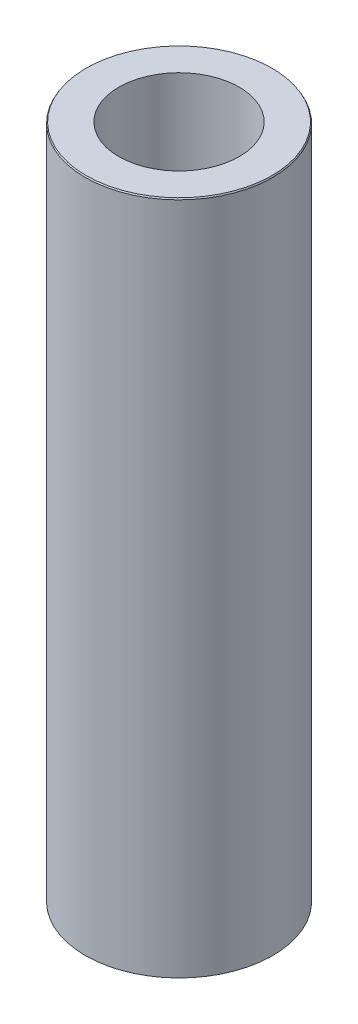
ISO-10303-21;
HEADER;
FILE_DESCRIPTION(('STEP AP214'),'2;1');
FILE_NAME('part.step','',(''),(''),'','','');
FILE_SCHEMA(('AUTOMOTIVE_DESIGN { 1 0 10303 214 1 1 1 1 }'));
ENDSEC;
DATA;
#1=APPLICATION_CONTEXT('core data for automotive mechanical design processes');
#2=APPLICATION_PROTOCOL_DEFINITION('international standard','automotive_design',2000,#1);
#3=PRODUCT_CONTEXT('',#1,'mechanical');
#4=PRODUCT('Part','Part','',(#3));
#5=PRODUCT_RELATED_PRODUCT_CATEGORY('part','',(#4));
#6=PRODUCT_DEFINITION_FORMATION('','',#4);
#7=PRODUCT_DEFINITION_CONTEXT('part definition',#1,'design');
#8=PRODUCT_DEFINITION('design','',#6,#7);
#9=PRODUCT_DEFINITION_SHAPE('','',#8);
#10=(LENGTH_UNIT() NAMED_UNIT(*) SI_UNIT(.MILLI.,.METRE.));
#11=(NAMED_UNIT(*) PLANE_ANGLE_UNIT() SI_UNIT($,.RADIAN.));
#12=(NAMED_UNIT(*) SI_UNIT($,.STERADIAN.) SOLID_ANGLE_UNIT());
#13=UNCERTAINTY_MEASURE_WITH_UNIT(LENGTH_MEASURE(1.E-05),#10,'distance_accuracy_value','');
#14=(GEOMETRIC_REPRESENTATION_CONTEXT(3) GLOBAL_UNCERTAINTY_ASSIGNED_CONTEXT((#13)) GLOBAL_UNIT_ASSIGNED_CONTEXT((#10,
#11,#12)) REPRESENTATION_CONTEXT('',''));
#15=CARTESIAN_POINT('',(0.,0.,0.));
#16=DIRECTION('',(0.,0.,1.));
#17=DIRECTION('',(1.,0.,0.));
#18=AXIS2_PLACEMENT_3D('',#15,#16,#17);
#19=CARTESIAN_POINT('',(0.,306.475914403811,0.));
#20=DIRECTION('',(0.,-1.,0.));
#21=DIRECTION('',(0.,0.,-1.));
#22=AXIS2_PLACEMENT_3D('',#19,#20,#21);
#23=CYLINDRICAL_SURFACE('',#22,42.5);
#24=CARTESIAN_POINT('',(0.,305.886490444852,0.));
#25=DIRECTION('',(0.,1.,0.));
#26=DIRECTION('',(0.,0.,1.));
#27=AXIS2_PLACEMENT_3D('',#24,#25,#26);
#28=CIRCLE('',#27,42.5);
#29=CARTESIAN_POINT('',(0.,305.886490444852,42.5));
#30=VERTEX_POINT('',#29);
#31=EDGE_CURVE('E50',#30,#30,#28,.F.);
#32=ORIENTED_EDGE('',*,*,#31,.T.);
#33=EDGE_LOOP('',(#32));
#34=FACE_BOUND('',#33,.T.);
#35=CARTESIAN_POINT('',(0.,0.340304081371645,0.));
#36=DIRECTION('',(0.,1.,0.));
#37=DIRECTION('',(0.,0.,1.));
#38=AXIS2_PLACEMENT_3D('',#35,#36,#37);
#39=CIRCLE('',#38,42.5);
#40=CARTESIAN_POINT('',(0.,0.340304081371645,42.5));
#41=VERTEX_POINT('',#40);
#42=EDGE_CURVE('E51',#41,#41,#39,.T.);
#43=ORIENTED_EDGE('',*,*,#42,.T.);
#44=EDGE_LOOP('',(#43));
#45=FACE_BOUND('',#44,.T.);
#46=ADVANCED_FACE('F39',(#34,#45),#23,.T.);
#47=CARTESIAN_POINT('',(0.,306.475914403811,0.));
#48=DIRECTION('',(0.,1.,0.));
#49=DIRECTION('',(0.,0.,1.));
#50=AXIS2_PLACEMENT_3D('',#47,#48,#49);
#51=PLANE('',#50);
#52=CARTESIAN_POINT('',(0.,306.475914403811,0.));
#53=DIRECTION('',(0.,1.,0.));
#54=DIRECTION('',(0.,0.,1.));
#55=AXIS2_PLACEMENT_3D('',#52,#53,#54);
#56=CIRCLE('',#55,42.1596959186283);
#57=CARTESIAN_POINT('',(0.,306.475914403811,42.1596959186283));
#58=VERTEX_POINT('',#57);
#59=EDGE_CURVE('E54',#58,#58,#56,.T.);
#60=ORIENTED_EDGE('',*,*,#59,.T.);
#61=EDGE_LOOP('',(#60));
#62=FACE_BOUND('',#61,.T.);
#63=CARTESIAN_POINT('',(0.,306.475914403811,0.));
#64=DIRECTION('',(0.,1.,0.));
#65=DIRECTION('',(0.,0.,1.));
#66=AXIS2_PLACEMENT_3D('',#63,#64,#65);
#67=CIRCLE('',#66,27.3050333120892);
#68=CARTESIAN_POINT('',(0.,306.475914403811,27.3050333120892));
#69=VERTEX_POINT('',#68);
#70=EDGE_CURVE('E58',#69,#69,#67,.T.);
#71=ORIENTED_EDGE('',*,*,#70,.F.);
#72=EDGE_LOOP('',(#71));
#73=FACE_BOUND('',#72,.T.);
#74=ADVANCED_FACE('F69',(#62,#73),#51,.T.);
#75=CARTESIAN_POINT('',(0.,0.,0.));
#76=DIRECTION('',(0.,1.,0.));
#77=DIRECTION('',(0.,0.,1.));
#78=AXIS2_PLACEMENT_3D('',#75,#76,#77);
#79=PLANE('',#78);
#80=CARTESIAN_POINT('',(0.,0.,0.));
#81=DIRECTION('',(0.,1.,0.));
#82=DIRECTION('',(0.,0.,1.));
#83=AXIS2_PLACEMENT_3D('',#80,#81,#82);
#84=CIRCLE('',#83,41.9105760410412);
#85=CARTESIAN_POINT('',(0.,0.,41.9105760410412));
#86=VERTEX_POINT('',#85);
#87=EDGE_CURVE('E10',#86,#86,#84,.F.);
#88=ORIENTED_EDGE('',*,*,#87,.T.);
#89=EDGE_LOOP('',(#88));
#90=FACE_BOUND('',#89,.T.);
#91=CARTESIAN_POINT('',(0.,0.,0.));
#92=DIRECTION('',(0.,1.,0.));
#93=DIRECTION('',(0.,0.,1.));
#94=AXIS2_PLACEMENT_3D('',#91,#92,#93);
#95=CIRCLE('',#94,27.3050333120892);
#96=CARTESIAN_POINT('',(0.,0.,27.3050333120892));
#97=VERTEX_POINT('',#96);
#98=EDGE_CURVE('E63',#97,#97,#95,.T.);
#99=ORIENTED_EDGE('',*,*,#98,.T.);
#100=EDGE_LOOP('',(#99));
#101=FACE_BOUND('',#100,.T.);
#102=ADVANCED_FACE('F75',(#90,#101),#79,.F.);
#103=CARTESIAN_POINT('',(0.,306.475914403811,0.));
#104=DIRECTION('',(0.,-1.,0.));
#105=DIRECTION('',(0.,0.,-1.));
#106=AXIS2_PLACEMENT_3D('',#103,#104,#105);
#107=CYLINDRICAL_SURFACE('',#106,27.3050333120892);
#108=ORIENTED_EDGE('',*,*,#70,.T.);
#109=EDGE_LOOP('',(#108));
#110=FACE_BOUND('',#109,.T.);
#111=ORIENTED_EDGE('',*,*,#98,.F.);
#112=EDGE_LOOP('',(#111));
#113=FACE_BOUND('',#112,.T.);
#114=ADVANCED_FACE('F70',(#110,#113),#107,.F.);
#115=CARTESIAN_POINT('',(0.,306.475914403811,0.));
#116=DIRECTION('',(0.,-1.,0.));
#117=DIRECTION('',(0.,0.,-1.));
#118=AXIS2_PLACEMENT_3D('',#115,#116,#117);
#119=CONICAL_SURFACE('',#118,42.1596959186283,0.523598775598308);
#120=ORIENTED_EDGE('',*,*,#31,.F.);
#121=EDGE_LOOP('',(#120));
#122=FACE_BOUND('',#121,.T.);
#123=ORIENTED_EDGE('',*,*,#59,.F.);
#124=EDGE_LOOP('',(#123));
#125=FACE_BOUND('',#124,.T.);
#126=ADVANCED_FACE('F81',(#122,#125),#119,.T.);
#127=CARTESIAN_POINT('',(0.,0.340304081371645,0.));
#128=DIRECTION('',(0.,1.,0.));
#129=DIRECTION('',(0.,0.,1.));
#130=AXIS2_PLACEMENT_3D('',#127,#128,#129);
#131=CONICAL_SURFACE('',#130,42.5,1.04719755119662);
#132=ORIENTED_EDGE('',*,*,#87,.F.);
#133=EDGE_LOOP('',(#132));
#134=FACE_BOUND('',#133,.T.);
#135=ORIENTED_EDGE('',*,*,#42,.F.);
#136=EDGE_LOOP('',(#135));
#137=FACE_BOUND('',#136,.T.);
#138=ADVANCED_FACE('F45',(#134,#137),#131,.T.);
#139=CLOSED_SHELL('',(#46,#74,#102,#114,#126,#138));
#140=MANIFOLD_SOLID_BREP('B2',#139);
#141=ADVANCED_BREP_SHAPE_REPRESENTATION('',(#18,#140),#14);
#142=SHAPE_DEFINITION_REPRESENTATION(#9,#141);
ENDSEC;
END-ISO-10303-21;
